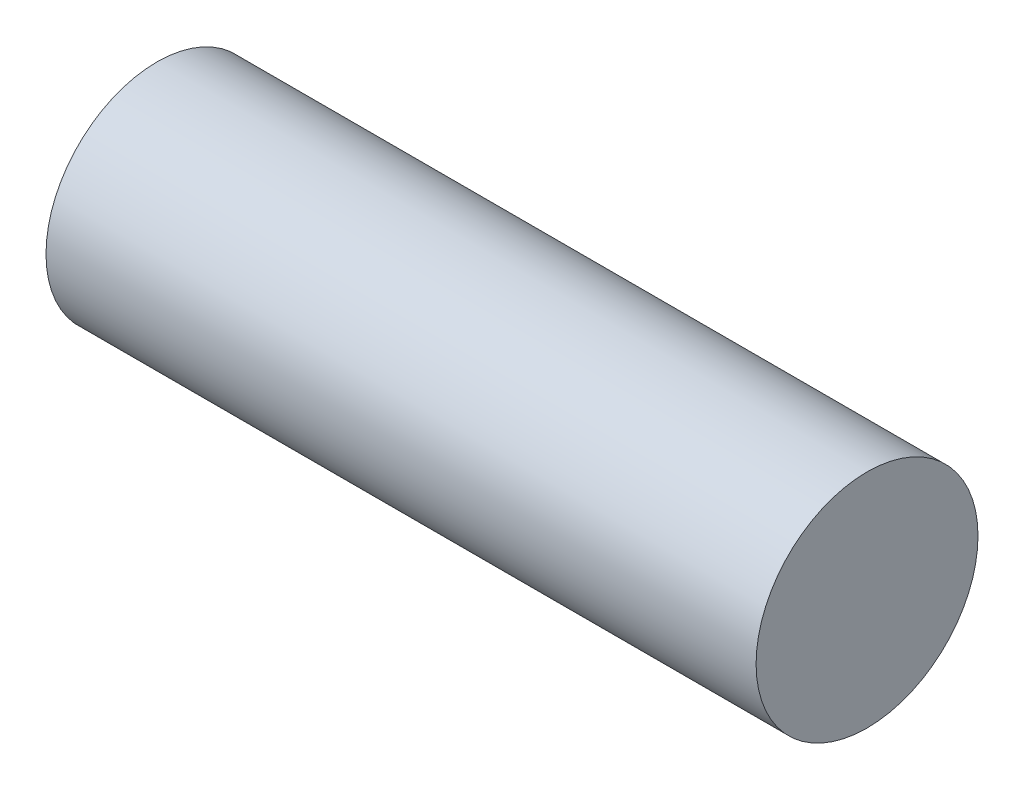
ISO-10303-21;
HEADER;
FILE_DESCRIPTION(('STEP AP214'),'2;1');
FILE_NAME('part.step','',(''),(''),'','','');
FILE_SCHEMA(('AUTOMOTIVE_DESIGN { 1 0 10303 214 1 1 1 1 }'));
ENDSEC;
DATA;
#1=APPLICATION_CONTEXT('core data for automotive mechanical design processes');
#2=APPLICATION_PROTOCOL_DEFINITION('international standard','automotive_design',2000,#1);
#3=PRODUCT_CONTEXT('',#1,'mechanical');
#4=PRODUCT('Part','Part','',(#3));
#5=PRODUCT_RELATED_PRODUCT_CATEGORY('part','',(#4));
#6=PRODUCT_DEFINITION_FORMATION('','',#4);
#7=PRODUCT_DEFINITION_CONTEXT('part definition',#1,'design');
#8=PRODUCT_DEFINITION('design','',#6,#7);
#9=PRODUCT_DEFINITION_SHAPE('','',#8);
#10=(LENGTH_UNIT() NAMED_UNIT(*) SI_UNIT(.MILLI.,.METRE.));
#11=(NAMED_UNIT(*) PLANE_ANGLE_UNIT() SI_UNIT($,.RADIAN.));
#12=(NAMED_UNIT(*) SI_UNIT($,.STERADIAN.) SOLID_ANGLE_UNIT());
#13=UNCERTAINTY_MEASURE_WITH_UNIT(LENGTH_MEASURE(1.E-05),#10,'distance_accuracy_value','');
#14=(GEOMETRIC_REPRESENTATION_CONTEXT(3) GLOBAL_UNCERTAINTY_ASSIGNED_CONTEXT((#13)) GLOBAL_UNIT_ASSIGNED_CONTEXT((#10,
#11,#12)) REPRESENTATION_CONTEXT('',''));
#15=CARTESIAN_POINT('',(0.,0.,0.));
#16=DIRECTION('',(0.,0.,1.));
#17=DIRECTION('',(1.,0.,0.));
#18=AXIS2_PLACEMENT_3D('',#15,#16,#17);
#19=CARTESIAN_POINT('',(16.,0.,0.));
#20=DIRECTION('',(-1.,0.,0.));
#21=DIRECTION('',(0.,0.,1.));
#22=AXIS2_PLACEMENT_3D('',#19,#20,#21);
#23=CYLINDRICAL_SURFACE('',#22,2.5);
#24=CARTESIAN_POINT('',(16.,0.,0.));
#25=DIRECTION('',(1.,0.,0.));
#26=DIRECTION('',(0.,0.,-1.));
#27=AXIS2_PLACEMENT_3D('',#24,#25,#26);
#28=CIRCLE('',#27,2.5);
#29=CARTESIAN_POINT('',(16.,0.,-2.5));
#30=VERTEX_POINT('',#29);
#31=EDGE_CURVE('E10',#30,#30,#28,.T.);
#32=ORIENTED_EDGE('',*,*,#31,.F.);
#33=EDGE_LOOP('',(#32));
#34=FACE_BOUND('',#33,.T.);
#35=CARTESIAN_POINT('',(0.,0.,0.));
#36=DIRECTION('',(1.,0.,0.));
#37=DIRECTION('',(0.,0.,-1.));
#38=AXIS2_PLACEMENT_3D('',#35,#36,#37);
#39=CIRCLE('',#38,2.5);
#40=CARTESIAN_POINT('',(0.,0.,-2.5));
#41=VERTEX_POINT('',#40);
#42=EDGE_CURVE('E46',#41,#41,#39,.T.);
#43=ORIENTED_EDGE('',*,*,#42,.T.);
#44=EDGE_LOOP('',(#43));
#45=FACE_BOUND('',#44,.T.);
#46=ADVANCED_FACE('F43',(#34,#45),#23,.T.);
#47=CARTESIAN_POINT('',(16.,0.,0.));
#48=DIRECTION('',(1.,0.,0.));
#49=DIRECTION('',(0.,0.,-1.));
#50=AXIS2_PLACEMENT_3D('',#47,#48,#49);
#51=PLANE('',#50);
#52=ORIENTED_EDGE('',*,*,#31,.T.);
#53=EDGE_LOOP('',(#52));
#54=FACE_BOUND('',#53,.T.);
#55=ADVANCED_FACE('F60',(#54),#51,.T.);
#56=CARTESIAN_POINT('',(0.,0.,0.));
#57=DIRECTION('',(1.,0.,0.));
#58=DIRECTION('',(0.,0.,-1.));
#59=AXIS2_PLACEMENT_3D('',#56,#57,#58);
#60=PLANE('',#59);
#61=ORIENTED_EDGE('',*,*,#42,.F.);
#62=EDGE_LOOP('',(#61));
#63=FACE_BOUND('',#62,.T.);
#64=ADVANCED_FACE('F58',(#63),#60,.F.);
#65=CLOSED_SHELL('',(#46,#55,#64));
#66=MANIFOLD_SOLID_BREP('B2',#65);
#67=ADVANCED_BREP_SHAPE_REPRESENTATION('',(#18,#66),#14);
#68=SHAPE_DEFINITION_REPRESENTATION(#9,#67);
ENDSEC;
END-ISO-10303-21;
